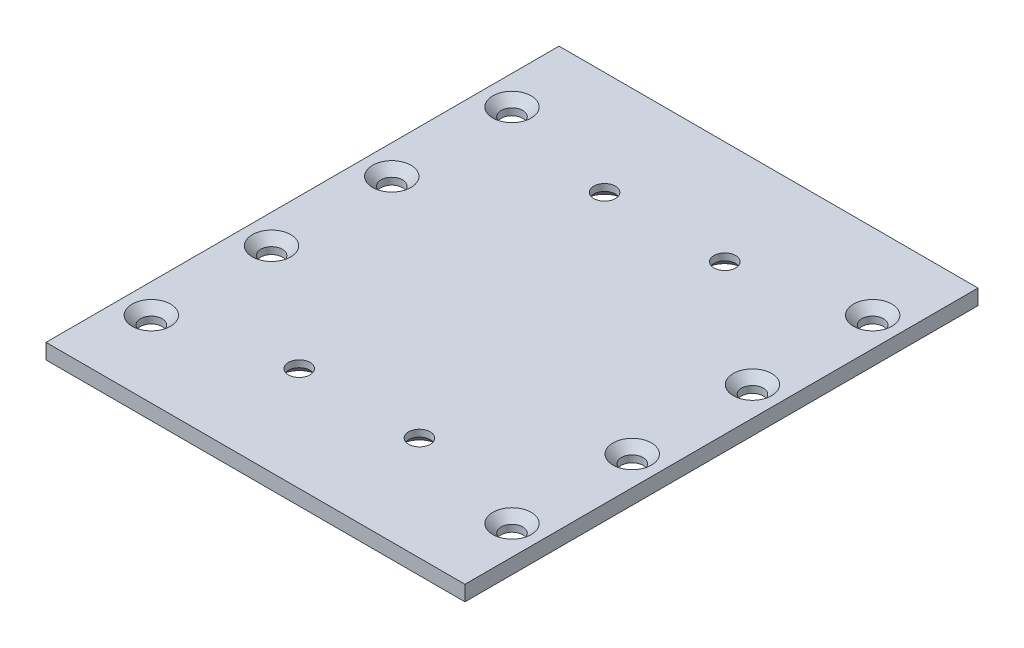
ISO-10303-21;
HEADER;
FILE_DESCRIPTION(('STEP AP214'),'2;1');
FILE_NAME('part.step','',(''),(''),'','','');
FILE_SCHEMA(('AUTOMOTIVE_DESIGN { 1 0 10303 214 1 1 1 1 }'));
ENDSEC;
DATA;
#1=APPLICATION_CONTEXT('core data for automotive mechanical design processes');
#2=APPLICATION_PROTOCOL_DEFINITION('international standard','automotive_design',2000,#1);
#3=PRODUCT_CONTEXT('',#1,'mechanical');
#4=PRODUCT('Part','Part','',(#3));
#5=PRODUCT_RELATED_PRODUCT_CATEGORY('part','',(#4));
#6=PRODUCT_DEFINITION_FORMATION('','',#4);
#7=PRODUCT_DEFINITION_CONTEXT('part definition',#1,'design');
#8=PRODUCT_DEFINITION('design','',#6,#7);
#9=PRODUCT_DEFINITION_SHAPE('','',#8);
#10=(LENGTH_UNIT() NAMED_UNIT(*) SI_UNIT(.MILLI.,.METRE.));
#11=(NAMED_UNIT(*) PLANE_ANGLE_UNIT() SI_UNIT($,.RADIAN.));
#12=(NAMED_UNIT(*) SI_UNIT($,.STERADIAN.) SOLID_ANGLE_UNIT());
#13=UNCERTAINTY_MEASURE_WITH_UNIT(LENGTH_MEASURE(1.E-05),#10,'distance_accuracy_value','');
#14=(GEOMETRIC_REPRESENTATION_CONTEXT(3) GLOBAL_UNCERTAINTY_ASSIGNED_CONTEXT((#13)) GLOBAL_UNIT_ASSIGNED_CONTEXT((#10,
#11,#12)) REPRESENTATION_CONTEXT('',''));
#15=CARTESIAN_POINT('',(0.,0.,0.));
#16=DIRECTION('',(0.,0.,1.));
#17=DIRECTION('',(1.,0.,0.));
#18=AXIS2_PLACEMENT_3D('',#15,#16,#17);
#19=CARTESIAN_POINT('',(-43.56,3.175,53.34));
#20=DIRECTION('',(0.,0.,-1.));
#21=DIRECTION('',(-1.,0.,0.));
#22=AXIS2_PLACEMENT_3D('',#19,#20,#21);
#23=PLANE('',#22);
#24=DIRECTION('',(1.,0.,0.));
#25=VECTOR('',#24,1.);
#26=CARTESIAN_POINT('',(-43.56,0.,53.34));
#27=LINE('',#26,#25);
#28=CARTESIAN_POINT('',(-43.56,0.,53.34));
#29=VERTEX_POINT('',#28);
#30=CARTESIAN_POINT('',(43.56,0.,53.34));
#31=VERTEX_POINT('',#30);
#32=EDGE_CURVE('E99',#29,#31,#27,.T.);
#33=ORIENTED_EDGE('',*,*,#32,.T.);
#34=DIRECTION('',(0.,-1.,0.));
#35=VECTOR('',#34,1.);
#36=CARTESIAN_POINT('',(43.56,3.175,53.34));
#37=LINE('',#36,#35);
#38=CARTESIAN_POINT('',(43.56,3.175,53.34));
#39=VERTEX_POINT('',#38);
#40=EDGE_CURVE('E11',#39,#31,#37,.T.);
#41=ORIENTED_EDGE('',*,*,#40,.F.);
#42=DIRECTION('',(1.,0.,0.));
#43=VECTOR('',#42,1.);
#44=CARTESIAN_POINT('',(-43.56,3.175,53.34));
#45=LINE('',#44,#43);
#46=CARTESIAN_POINT('',(-43.56,3.175,53.34));
#47=VERTEX_POINT('',#46);
#48=EDGE_CURVE('E75',#47,#39,#45,.T.);
#49=ORIENTED_EDGE('',*,*,#48,.F.);
#50=DIRECTION('',(0.,-1.,0.));
#51=VECTOR('',#50,1.);
#52=CARTESIAN_POINT('',(-43.56,3.175,53.34));
#53=LINE('',#52,#51);
#54=EDGE_CURVE('E95',#47,#29,#53,.T.);
#55=ORIENTED_EDGE('',*,*,#54,.T.);
#56=EDGE_LOOP('',(#33,#41,#49,#55));
#57=FACE_BOUND('',#56,.T.);
#58=ADVANCED_FACE('F34',(#57),#23,.F.);
#59=CARTESIAN_POINT('',(43.56,3.175,-53.34));
#60=DIRECTION('',(1.,0.,0.));
#61=DIRECTION('',(0.,0.,-1.));
#62=AXIS2_PLACEMENT_3D('',#59,#60,#61);
#63=PLANE('',#62);
#64=DIRECTION('',(0.,0.,1.));
#65=VECTOR('',#64,1.);
#66=CARTESIAN_POINT('',(43.56,0.,-53.34));
#67=LINE('',#66,#65);
#68=CARTESIAN_POINT('',(43.56,0.,-53.34));
#69=VERTEX_POINT('',#68);
#70=EDGE_CURVE('E84',#69,#31,#67,.T.);
#71=ORIENTED_EDGE('',*,*,#70,.F.);
#72=DIRECTION('',(0.,-1.,0.));
#73=VECTOR('',#72,1.);
#74=CARTESIAN_POINT('',(43.56,3.175,-53.34));
#75=LINE('',#74,#73);
#76=CARTESIAN_POINT('',(43.56,3.175,-53.34));
#77=VERTEX_POINT('',#76);
#78=EDGE_CURVE('E43',#77,#69,#75,.T.);
#79=ORIENTED_EDGE('',*,*,#78,.F.);
#80=DIRECTION('',(0.,0.,1.));
#81=VECTOR('',#80,1.);
#82=CARTESIAN_POINT('',(43.56,3.175,-53.34));
#83=LINE('',#82,#81);
#84=EDGE_CURVE('E82',#77,#39,#83,.T.);
#85=ORIENTED_EDGE('',*,*,#84,.T.);
#86=ORIENTED_EDGE('',*,*,#40,.T.);
#87=EDGE_LOOP('',(#71,#79,#85,#86));
#88=FACE_BOUND('',#87,.T.);
#89=ADVANCED_FACE('F81',(#88),#63,.T.);
#90=CARTESIAN_POINT('',(-43.56,3.175,-53.34));
#91=DIRECTION('',(0.,0.,-1.));
#92=DIRECTION('',(-1.,0.,0.));
#93=AXIS2_PLACEMENT_3D('',#90,#91,#92);
#94=PLANE('',#93);
#95=DIRECTION('',(1.,0.,0.));
#96=VECTOR('',#95,1.);
#97=CARTESIAN_POINT('',(-43.56,0.,-53.34));
#98=LINE('',#97,#96);
#99=CARTESIAN_POINT('',(-43.56,0.,-53.34));
#100=VERTEX_POINT('',#99);
#101=EDGE_CURVE('E104',#100,#69,#98,.T.);
#102=ORIENTED_EDGE('',*,*,#101,.F.);
#103=DIRECTION('',(0.,-1.,0.));
#104=VECTOR('',#103,1.);
#105=CARTESIAN_POINT('',(-43.56,3.175,-53.34));
#106=LINE('',#105,#104);
#107=CARTESIAN_POINT('',(-43.56,3.175,-53.34));
#108=VERTEX_POINT('',#107);
#109=EDGE_CURVE('E67',#108,#100,#106,.T.);
#110=ORIENTED_EDGE('',*,*,#109,.F.);
#111=DIRECTION('',(1.,0.,0.));
#112=VECTOR('',#111,1.);
#113=CARTESIAN_POINT('',(-43.56,3.175,-53.34));
#114=LINE('',#113,#112);
#115=EDGE_CURVE('E91',#108,#77,#114,.T.);
#116=ORIENTED_EDGE('',*,*,#115,.T.);
#117=ORIENTED_EDGE('',*,*,#78,.T.);
#118=EDGE_LOOP('',(#102,#110,#116,#117));
#119=FACE_BOUND('',#118,.T.);
#120=ADVANCED_FACE('F93',(#119),#94,.T.);
#121=CARTESIAN_POINT('',(-43.56,3.175,-53.34));
#122=DIRECTION('',(1.,0.,0.));
#123=DIRECTION('',(0.,0.,-1.));
#124=AXIS2_PLACEMENT_3D('',#121,#122,#123);
#125=PLANE('',#124);
#126=DIRECTION('',(0.,0.,1.));
#127=VECTOR('',#126,1.);
#128=CARTESIAN_POINT('',(-43.56,0.,-53.34));
#129=LINE('',#128,#127);
#130=EDGE_CURVE('E70',#100,#29,#129,.T.);
#131=ORIENTED_EDGE('',*,*,#130,.T.);
#132=ORIENTED_EDGE('',*,*,#54,.F.);
#133=DIRECTION('',(0.,0.,1.));
#134=VECTOR('',#133,1.);
#135=CARTESIAN_POINT('',(-43.56,3.175,-53.34));
#136=LINE('',#135,#134);
#137=EDGE_CURVE('E52',#108,#47,#136,.T.);
#138=ORIENTED_EDGE('',*,*,#137,.F.);
#139=ORIENTED_EDGE('',*,*,#109,.T.);
#140=EDGE_LOOP('',(#131,#132,#138,#139));
#141=FACE_BOUND('',#140,.T.);
#142=ADVANCED_FACE('F216',(#141),#125,.F.);
#143=CARTESIAN_POINT('',(0.,3.175,0.));
#144=DIRECTION('',(0.,-1.,0.));
#145=DIRECTION('',(0.,0.,-1.));
#146=AXIS2_PLACEMENT_3D('',#143,#144,#145);
#147=PLANE('',#146);
#148=CARTESIAN_POINT('',(12.5,3.175,31.75));
#149=DIRECTION('',(0.,-1.,0.));
#150=DIRECTION('',(0.,0.,-1.));
#151=AXIS2_PLACEMENT_3D('',#148,#149,#150);
#152=CIRCLE('',#151,2.25);
#153=CARTESIAN_POINT('',(12.5,3.175,29.5));
#154=VERTEX_POINT('',#153);
#155=EDGE_CURVE('E37',#154,#154,#152,.T.);
#156=ORIENTED_EDGE('',*,*,#155,.T.);
#157=EDGE_LOOP('',(#156));
#158=FACE_BOUND('',#157,.T.);
#159=CARTESIAN_POINT('',(-12.5,3.175,31.75));
#160=DIRECTION('',(0.,-1.,0.));
#161=DIRECTION('',(0.,0.,-1.));
#162=AXIS2_PLACEMENT_3D('',#159,#160,#161);
#163=CIRCLE('',#162,2.25);
#164=CARTESIAN_POINT('',(-12.5,3.175,29.5));
#165=VERTEX_POINT('',#164);
#166=EDGE_CURVE('E118',#165,#165,#163,.T.);
#167=ORIENTED_EDGE('',*,*,#166,.T.);
#168=EDGE_LOOP('',(#167));
#169=FACE_BOUND('',#168,.T.);
#170=CARTESIAN_POINT('',(12.5,3.175,-31.75));
#171=DIRECTION('',(0.,-1.,0.));
#172=DIRECTION('',(0.,0.,-1.));
#173=AXIS2_PLACEMENT_3D('',#170,#171,#172);
#174=CIRCLE('',#173,2.25);
#175=CARTESIAN_POINT('',(12.5,3.175,-34.));
#176=VERTEX_POINT('',#175);
#177=EDGE_CURVE('E114',#176,#176,#174,.T.);
#178=ORIENTED_EDGE('',*,*,#177,.T.);
#179=EDGE_LOOP('',(#178));
#180=FACE_BOUND('',#179,.T.);
#181=CARTESIAN_POINT('',(-12.5,3.175,-31.75));
#182=DIRECTION('',(0.,-1.,0.));
#183=DIRECTION('',(0.,0.,-1.));
#184=AXIS2_PLACEMENT_3D('',#181,#182,#183);
#185=CIRCLE('',#184,2.25);
#186=CARTESIAN_POINT('',(-12.5,3.175,-34.));
#187=VERTEX_POINT('',#186);
#188=EDGE_CURVE('E109',#187,#187,#185,.T.);
#189=ORIENTED_EDGE('',*,*,#188,.T.);
#190=EDGE_LOOP('',(#189));
#191=FACE_BOUND('',#190,.T.);
#192=CARTESIAN_POINT('',(-37.5000000000002,3.175,-37.5));
#193=DIRECTION('',(0.,1.,0.));
#194=DIRECTION('',(0.,0.,1.));
#195=AXIS2_PLACEMENT_3D('',#192,#193,#194);
#196=CIRCLE('',#195,4.);
#197=CARTESIAN_POINT('',(-37.5000000000002,3.175,-33.5));
#198=VERTEX_POINT('',#197);
#199=EDGE_CURVE('E146',#198,#198,#196,.T.);
#200=ORIENTED_EDGE('',*,*,#199,.F.);
#201=EDGE_LOOP('',(#200));
#202=FACE_BOUND('',#201,.T.);
#203=CARTESIAN_POINT('',(-37.5000000000002,3.175,-12.5));
#204=DIRECTION('',(0.,1.,0.));
#205=DIRECTION('',(0.,0.,1.));
#206=AXIS2_PLACEMENT_3D('',#203,#204,#205);
#207=CIRCLE('',#206,4.);
#208=CARTESIAN_POINT('',(-37.5000000000002,3.175,-8.50000000000001));
#209=VERTEX_POINT('',#208);
#210=EDGE_CURVE('E155',#209,#209,#207,.T.);
#211=ORIENTED_EDGE('',*,*,#210,.F.);
#212=EDGE_LOOP('',(#211));
#213=FACE_BOUND('',#212,.T.);
#214=CARTESIAN_POINT('',(37.4999999999998,3.175,-37.5));
#215=DIRECTION('',(0.,1.,0.));
#216=DIRECTION('',(0.,0.,1.));
#217=AXIS2_PLACEMENT_3D('',#214,#215,#216);
#218=CIRCLE('',#217,4.);
#219=CARTESIAN_POINT('',(37.4999999999998,3.175,-33.5));
#220=VERTEX_POINT('',#219);
#221=EDGE_CURVE('E164',#220,#220,#218,.T.);
#222=ORIENTED_EDGE('',*,*,#221,.F.);
#223=EDGE_LOOP('',(#222));
#224=FACE_BOUND('',#223,.T.);
#225=CARTESIAN_POINT('',(37.4999999999999,3.175,-12.5));
#226=DIRECTION('',(0.,1.,0.));
#227=DIRECTION('',(0.,0.,1.));
#228=AXIS2_PLACEMENT_3D('',#225,#226,#227);
#229=CIRCLE('',#228,4.);
#230=CARTESIAN_POINT('',(37.4999999999999,3.175,-8.5));
#231=VERTEX_POINT('',#230);
#232=EDGE_CURVE('E173',#231,#231,#229,.T.);
#233=ORIENTED_EDGE('',*,*,#232,.F.);
#234=EDGE_LOOP('',(#233));
#235=FACE_BOUND('',#234,.T.);
#236=CARTESIAN_POINT('',(37.4999999999999,3.175,12.5));
#237=DIRECTION('',(0.,1.,0.));
#238=DIRECTION('',(0.,0.,1.));
#239=AXIS2_PLACEMENT_3D('',#236,#237,#238);
#240=CIRCLE('',#239,4.);
#241=CARTESIAN_POINT('',(37.4999999999999,3.175,16.5));
#242=VERTEX_POINT('',#241);
#243=EDGE_CURVE('E182',#242,#242,#240,.T.);
#244=ORIENTED_EDGE('',*,*,#243,.F.);
#245=EDGE_LOOP('',(#244));
#246=FACE_BOUND('',#245,.T.);
#247=CARTESIAN_POINT('',(37.5,3.175,37.5));
#248=DIRECTION('',(0.,1.,0.));
#249=DIRECTION('',(0.,0.,1.));
#250=AXIS2_PLACEMENT_3D('',#247,#248,#249);
#251=CIRCLE('',#250,4.);
#252=CARTESIAN_POINT('',(37.5,3.175,41.5));
#253=VERTEX_POINT('',#252);
#254=EDGE_CURVE('E191',#253,#253,#251,.T.);
#255=ORIENTED_EDGE('',*,*,#254,.F.);
#256=EDGE_LOOP('',(#255));
#257=FACE_BOUND('',#256,.T.);
#258=CARTESIAN_POINT('',(-37.5,3.175,37.5));
#259=DIRECTION('',(0.,1.,0.));
#260=DIRECTION('',(0.,0.,1.));
#261=AXIS2_PLACEMENT_3D('',#258,#259,#260);
#262=CIRCLE('',#261,4.);
#263=CARTESIAN_POINT('',(-37.5,3.175,41.5));
#264=VERTEX_POINT('',#263);
#265=EDGE_CURVE('E200',#264,#264,#262,.T.);
#266=ORIENTED_EDGE('',*,*,#265,.F.);
#267=EDGE_LOOP('',(#266));
#268=FACE_BOUND('',#267,.T.);
#269=CARTESIAN_POINT('',(-37.5000000000001,3.175,12.5));
#270=DIRECTION('',(0.,1.,0.));
#271=DIRECTION('',(0.,0.,1.));
#272=AXIS2_PLACEMENT_3D('',#269,#270,#271);
#273=CIRCLE('',#272,4.);
#274=CARTESIAN_POINT('',(-37.5000000000001,3.175,16.5));
#275=VERTEX_POINT('',#274);
#276=EDGE_CURVE('E102',#275,#275,#273,.T.);
#277=ORIENTED_EDGE('',*,*,#276,.F.);
#278=EDGE_LOOP('',(#277));
#279=FACE_BOUND('',#278,.T.);
#280=ORIENTED_EDGE('',*,*,#48,.T.);
#281=ORIENTED_EDGE('',*,*,#84,.F.);
#282=ORIENTED_EDGE('',*,*,#115,.F.);
#283=ORIENTED_EDGE('',*,*,#137,.T.);
#284=EDGE_LOOP('',(#280,#281,#282,#283));
#285=FACE_BOUND('',#284,.T.);
#286=ADVANCED_FACE('F90',(#158,#169,#180,#191,#202,#213,#224,#235,#246,#257,#268,#279,#285),
#147,.F.);
#287=CARTESIAN_POINT('',(0.,0.,0.));
#288=DIRECTION('',(0.,-1.,0.));
#289=DIRECTION('',(0.,0.,-1.));
#290=AXIS2_PLACEMENT_3D('',#287,#288,#289);
#291=PLANE('',#290);
#292=CARTESIAN_POINT('',(12.5,0.,31.75));
#293=DIRECTION('',(0.,-1.,0.));
#294=DIRECTION('',(0.,0.,-1.));
#295=AXIS2_PLACEMENT_3D('',#292,#293,#294);
#296=CIRCLE('',#295,4.);
#297=CARTESIAN_POINT('',(12.5,0.,27.75));
#298=VERTEX_POINT('',#297);
#299=EDGE_CURVE('E502',#298,#298,#296,.T.);
#300=ORIENTED_EDGE('',*,*,#299,.F.);
#301=EDGE_LOOP('',(#300));
#302=FACE_BOUND('',#301,.T.);
#303=CARTESIAN_POINT('',(-12.5,0.,31.75));
#304=DIRECTION('',(0.,-1.,0.));
#305=DIRECTION('',(0.,0.,-1.));
#306=AXIS2_PLACEMENT_3D('',#303,#304,#305);
#307=CIRCLE('',#306,4.);
#308=CARTESIAN_POINT('',(-12.5,0.,27.75));
#309=VERTEX_POINT('',#308);
#310=EDGE_CURVE('E127',#309,#309,#307,.T.);
#311=ORIENTED_EDGE('',*,*,#310,.F.);
#312=EDGE_LOOP('',(#311));
#313=FACE_BOUND('',#312,.T.);
#314=CARTESIAN_POINT('',(12.5,0.,-31.75));
#315=DIRECTION('',(0.,-1.,0.));
#316=DIRECTION('',(0.,0.,-1.));
#317=AXIS2_PLACEMENT_3D('',#314,#315,#316);
#318=CIRCLE('',#317,4.);
#319=CARTESIAN_POINT('',(12.5,0.,-35.75));
#320=VERTEX_POINT('',#319);
#321=EDGE_CURVE('E120',#320,#320,#318,.T.);
#322=ORIENTED_EDGE('',*,*,#321,.F.);
#323=EDGE_LOOP('',(#322));
#324=FACE_BOUND('',#323,.T.);
#325=CARTESIAN_POINT('',(-12.5,0.,-31.75));
#326=DIRECTION('',(0.,-1.,0.));
#327=DIRECTION('',(0.,0.,-1.));
#328=AXIS2_PLACEMENT_3D('',#325,#326,#327);
#329=CIRCLE('',#328,4.);
#330=CARTESIAN_POINT('',(-12.5,0.,-35.75));
#331=VERTEX_POINT('',#330);
#332=EDGE_CURVE('E116',#331,#331,#329,.T.);
#333=ORIENTED_EDGE('',*,*,#332,.F.);
#334=EDGE_LOOP('',(#333));
#335=FACE_BOUND('',#334,.T.);
#336=CARTESIAN_POINT('',(-37.5000000000002,0.,-37.5));
#337=DIRECTION('',(0.,1.,0.));
#338=DIRECTION('',(0.,0.,1.));
#339=AXIS2_PLACEMENT_3D('',#336,#337,#338);
#340=CIRCLE('',#339,2.25);
#341=CARTESIAN_POINT('',(-37.5000000000002,0.,-35.25));
#342=VERTEX_POINT('',#341);
#343=EDGE_CURVE('E112',#342,#342,#340,.T.);
#344=ORIENTED_EDGE('',*,*,#343,.T.);
#345=EDGE_LOOP('',(#344));
#346=FACE_BOUND('',#345,.T.);
#347=CARTESIAN_POINT('',(-37.5000000000002,0.,-12.5));
#348=DIRECTION('',(0.,1.,0.));
#349=DIRECTION('',(0.,0.,1.));
#350=AXIS2_PLACEMENT_3D('',#347,#348,#349);
#351=CIRCLE('',#350,2.25);
#352=CARTESIAN_POINT('',(-37.5000000000002,0.,-10.25));
#353=VERTEX_POINT('',#352);
#354=EDGE_CURVE('E149',#353,#353,#351,.T.);
#355=ORIENTED_EDGE('',*,*,#354,.T.);
#356=EDGE_LOOP('',(#355));
#357=FACE_BOUND('',#356,.T.);
#358=CARTESIAN_POINT('',(37.4999999999998,0.,-37.5));
#359=DIRECTION('',(0.,1.,0.));
#360=DIRECTION('',(0.,0.,1.));
#361=AXIS2_PLACEMENT_3D('',#358,#359,#360);
#362=CIRCLE('',#361,2.25);
#363=CARTESIAN_POINT('',(37.4999999999998,0.,-35.25));
#364=VERTEX_POINT('',#363);
#365=EDGE_CURVE('E158',#364,#364,#362,.T.);
#366=ORIENTED_EDGE('',*,*,#365,.T.);
#367=EDGE_LOOP('',(#366));
#368=FACE_BOUND('',#367,.T.);
#369=CARTESIAN_POINT('',(37.4999999999999,0.,-12.5));
#370=DIRECTION('',(0.,1.,0.));
#371=DIRECTION('',(0.,0.,1.));
#372=AXIS2_PLACEMENT_3D('',#369,#370,#371);
#373=CIRCLE('',#372,2.25);
#374=CARTESIAN_POINT('',(37.4999999999999,0.,-10.25));
#375=VERTEX_POINT('',#374);
#376=EDGE_CURVE('E167',#375,#375,#373,.T.);
#377=ORIENTED_EDGE('',*,*,#376,.T.);
#378=EDGE_LOOP('',(#377));
#379=FACE_BOUND('',#378,.T.);
#380=CARTESIAN_POINT('',(37.4999999999999,0.,12.5));
#381=DIRECTION('',(0.,1.,0.));
#382=DIRECTION('',(0.,0.,1.));
#383=AXIS2_PLACEMENT_3D('',#380,#381,#382);
#384=CIRCLE('',#383,2.25);
#385=CARTESIAN_POINT('',(37.4999999999999,0.,14.75));
#386=VERTEX_POINT('',#385);
#387=EDGE_CURVE('E176',#386,#386,#384,.T.);
#388=ORIENTED_EDGE('',*,*,#387,.T.);
#389=EDGE_LOOP('',(#388));
#390=FACE_BOUND('',#389,.T.);
#391=CARTESIAN_POINT('',(37.5,0.,37.5));
#392=DIRECTION('',(0.,1.,0.));
#393=DIRECTION('',(0.,0.,1.));
#394=AXIS2_PLACEMENT_3D('',#391,#392,#393);
#395=CIRCLE('',#394,2.25);
#396=CARTESIAN_POINT('',(37.5,0.,39.75));
#397=VERTEX_POINT('',#396);
#398=EDGE_CURVE('E185',#397,#397,#395,.T.);
#399=ORIENTED_EDGE('',*,*,#398,.T.);
#400=EDGE_LOOP('',(#399));
#401=FACE_BOUND('',#400,.T.);
#402=CARTESIAN_POINT('',(-37.5,0.,37.5));
#403=DIRECTION('',(0.,1.,0.));
#404=DIRECTION('',(0.,0.,1.));
#405=AXIS2_PLACEMENT_3D('',#402,#403,#404);
#406=CIRCLE('',#405,2.25);
#407=CARTESIAN_POINT('',(-37.5,0.,39.75));
#408=VERTEX_POINT('',#407);
#409=EDGE_CURVE('E194',#408,#408,#406,.T.);
#410=ORIENTED_EDGE('',*,*,#409,.T.);
#411=EDGE_LOOP('',(#410));
#412=FACE_BOUND('',#411,.T.);
#413=CARTESIAN_POINT('',(-37.5000000000001,0.,12.5));
#414=DIRECTION('',(0.,1.,0.));
#415=DIRECTION('',(0.,0.,1.));
#416=AXIS2_PLACEMENT_3D('',#413,#414,#415);
#417=CIRCLE('',#416,2.25);
#418=CARTESIAN_POINT('',(-37.5000000000001,0.,14.75));
#419=VERTEX_POINT('',#418);
#420=EDGE_CURVE('E203',#419,#419,#417,.T.);
#421=ORIENTED_EDGE('',*,*,#420,.T.);
#422=EDGE_LOOP('',(#421));
#423=FACE_BOUND('',#422,.T.);
#424=ORIENTED_EDGE('',*,*,#32,.F.);
#425=ORIENTED_EDGE('',*,*,#130,.F.);
#426=ORIENTED_EDGE('',*,*,#101,.T.);
#427=ORIENTED_EDGE('',*,*,#70,.T.);
#428=EDGE_LOOP('',(#424,#425,#426,#427));
#429=FACE_BOUND('',#428,.T.);
#430=ADVANCED_FACE('F215',(#302,#313,#324,#335,#346,#357,#368,#379,#390,#401,#412,#423,#429),
#291,.T.);
#431=CARTESIAN_POINT('',(-37.5000000000001,3.175,12.5));
#432=DIRECTION('',(0.,1.,0.));
#433=DIRECTION('',(0.,0.,1.));
#434=AXIS2_PLACEMENT_3D('',#431,#432,#433);
#435=CONICAL_SURFACE('',#434,4.,0.785398163397449);
#436=CARTESIAN_POINT('',(-37.5000000000001,1.425,12.5));
#437=DIRECTION('',(0.,1.,0.));
#438=DIRECTION('',(0.,0.,1.));
#439=AXIS2_PLACEMENT_3D('',#436,#437,#438);
#440=CIRCLE('',#439,2.25);
#441=CARTESIAN_POINT('',(-37.5000000000001,1.425,14.75));
#442=VERTEX_POINT('',#441);
#443=EDGE_CURVE('E206',#442,#442,#440,.T.);
#444=ORIENTED_EDGE('',*,*,#443,.F.);
#445=EDGE_LOOP('',(#444));
#446=FACE_BOUND('',#445,.T.);
#447=ORIENTED_EDGE('',*,*,#276,.T.);
#448=EDGE_LOOP('',(#447));
#449=FACE_BOUND('',#448,.T.);
#450=ADVANCED_FACE('F212',(#446,#449),#435,.F.);
#451=CARTESIAN_POINT('',(-37.5000000000001,3.175,12.5));
#452=DIRECTION('',(0.,1.,0.));
#453=DIRECTION('',(0.,0.,1.));
#454=AXIS2_PLACEMENT_3D('',#451,#452,#453);
#455=CYLINDRICAL_SURFACE('',#454,2.25);
#456=ORIENTED_EDGE('',*,*,#420,.F.);
#457=EDGE_LOOP('',(#456));
#458=FACE_BOUND('',#457,.T.);
#459=ORIENTED_EDGE('',*,*,#443,.T.);
#460=EDGE_LOOP('',(#459));
#461=FACE_BOUND('',#460,.T.);
#462=ADVANCED_FACE('F255',(#458,#461),#455,.F.);
#463=CARTESIAN_POINT('',(-37.5,3.175,37.5));
#464=DIRECTION('',(0.,1.,0.));
#465=DIRECTION('',(0.,0.,1.));
#466=AXIS2_PLACEMENT_3D('',#463,#464,#465);
#467=CONICAL_SURFACE('',#466,4.,0.785398163397449);
#468=CARTESIAN_POINT('',(-37.5,1.425,37.5));
#469=DIRECTION('',(0.,1.,0.));
#470=DIRECTION('',(0.,0.,1.));
#471=AXIS2_PLACEMENT_3D('',#468,#469,#470);
#472=CIRCLE('',#471,2.25);
#473=CARTESIAN_POINT('',(-37.5,1.425,39.75));
#474=VERTEX_POINT('',#473);
#475=EDGE_CURVE('E197',#474,#474,#472,.T.);
#476=ORIENTED_EDGE('',*,*,#475,.F.);
#477=EDGE_LOOP('',(#476));
#478=FACE_BOUND('',#477,.T.);
#479=ORIENTED_EDGE('',*,*,#265,.T.);
#480=EDGE_LOOP('',(#479));
#481=FACE_BOUND('',#480,.T.);
#482=ADVANCED_FACE('F265',(#478,#481),#467,.F.);
#483=CARTESIAN_POINT('',(-37.5,3.175,37.5));
#484=DIRECTION('',(0.,1.,0.));
#485=DIRECTION('',(0.,0.,1.));
#486=AXIS2_PLACEMENT_3D('',#483,#484,#485);
#487=CYLINDRICAL_SURFACE('',#486,2.25);
#488=ORIENTED_EDGE('',*,*,#409,.F.);
#489=EDGE_LOOP('',(#488));
#490=FACE_BOUND('',#489,.T.);
#491=ORIENTED_EDGE('',*,*,#475,.T.);
#492=EDGE_LOOP('',(#491));
#493=FACE_BOUND('',#492,.T.);
#494=ADVANCED_FACE('F275',(#490,#493),#487,.F.);
#495=CARTESIAN_POINT('',(37.5,3.175,37.5));
#496=DIRECTION('',(0.,1.,0.));
#497=DIRECTION('',(0.,0.,1.));
#498=AXIS2_PLACEMENT_3D('',#495,#496,#497);
#499=CONICAL_SURFACE('',#498,4.,0.785398163397449);
#500=CARTESIAN_POINT('',(37.5,1.425,37.5));
#501=DIRECTION('',(0.,1.,0.));
#502=DIRECTION('',(0.,0.,1.));
#503=AXIS2_PLACEMENT_3D('',#500,#501,#502);
#504=CIRCLE('',#503,2.25);
#505=CARTESIAN_POINT('',(37.5,1.425,39.75));
#506=VERTEX_POINT('',#505);
#507=EDGE_CURVE('E188',#506,#506,#504,.T.);
#508=ORIENTED_EDGE('',*,*,#507,.F.);
#509=EDGE_LOOP('',(#508));
#510=FACE_BOUND('',#509,.T.);
#511=ORIENTED_EDGE('',*,*,#254,.T.);
#512=EDGE_LOOP('',(#511));
#513=FACE_BOUND('',#512,.T.);
#514=ADVANCED_FACE('F285',(#510,#513),#499,.F.);
#515=CARTESIAN_POINT('',(37.5,3.175,37.5));
#516=DIRECTION('',(0.,1.,0.));
#517=DIRECTION('',(0.,0.,1.));
#518=AXIS2_PLACEMENT_3D('',#515,#516,#517);
#519=CYLINDRICAL_SURFACE('',#518,2.25);
#520=ORIENTED_EDGE('',*,*,#398,.F.);
#521=EDGE_LOOP('',(#520));
#522=FACE_BOUND('',#521,.T.);
#523=ORIENTED_EDGE('',*,*,#507,.T.);
#524=EDGE_LOOP('',(#523));
#525=FACE_BOUND('',#524,.T.);
#526=ADVANCED_FACE('F295',(#522,#525),#519,.F.);
#527=CARTESIAN_POINT('',(37.4999999999999,3.175,12.5));
#528=DIRECTION('',(0.,1.,0.));
#529=DIRECTION('',(0.,0.,1.));
#530=AXIS2_PLACEMENT_3D('',#527,#528,#529);
#531=CONICAL_SURFACE('',#530,4.,0.785398163397449);
#532=CARTESIAN_POINT('',(37.4999999999999,1.425,12.5));
#533=DIRECTION('',(0.,1.,0.));
#534=DIRECTION('',(0.,0.,1.));
#535=AXIS2_PLACEMENT_3D('',#532,#533,#534);
#536=CIRCLE('',#535,2.25);
#537=CARTESIAN_POINT('',(37.4999999999999,1.425,14.75));
#538=VERTEX_POINT('',#537);
#539=EDGE_CURVE('E179',#538,#538,#536,.T.);
#540=ORIENTED_EDGE('',*,*,#539,.F.);
#541=EDGE_LOOP('',(#540));
#542=FACE_BOUND('',#541,.T.);
#543=ORIENTED_EDGE('',*,*,#243,.T.);
#544=EDGE_LOOP('',(#543));
#545=FACE_BOUND('',#544,.T.);
#546=ADVANCED_FACE('F305',(#542,#545),#531,.F.);
#547=CARTESIAN_POINT('',(37.4999999999999,3.175,12.5));
#548=DIRECTION('',(0.,1.,0.));
#549=DIRECTION('',(0.,0.,1.));
#550=AXIS2_PLACEMENT_3D('',#547,#548,#549);
#551=CYLINDRICAL_SURFACE('',#550,2.25);
#552=ORIENTED_EDGE('',*,*,#387,.F.);
#553=EDGE_LOOP('',(#552));
#554=FACE_BOUND('',#553,.T.);
#555=ORIENTED_EDGE('',*,*,#539,.T.);
#556=EDGE_LOOP('',(#555));
#557=FACE_BOUND('',#556,.T.);
#558=ADVANCED_FACE('F315',(#554,#557),#551,.F.);
#559=CARTESIAN_POINT('',(37.4999999999999,3.175,-12.5));
#560=DIRECTION('',(0.,1.,0.));
#561=DIRECTION('',(0.,0.,1.));
#562=AXIS2_PLACEMENT_3D('',#559,#560,#561);
#563=CONICAL_SURFACE('',#562,4.,0.785398163397449);
#564=CARTESIAN_POINT('',(37.4999999999999,1.425,-12.5));
#565=DIRECTION('',(0.,1.,0.));
#566=DIRECTION('',(0.,0.,1.));
#567=AXIS2_PLACEMENT_3D('',#564,#565,#566);
#568=CIRCLE('',#567,2.25);
#569=CARTESIAN_POINT('',(37.4999999999999,1.425,-10.25));
#570=VERTEX_POINT('',#569);
#571=EDGE_CURVE('E170',#570,#570,#568,.T.);
#572=ORIENTED_EDGE('',*,*,#571,.F.);
#573=EDGE_LOOP('',(#572));
#574=FACE_BOUND('',#573,.T.);
#575=ORIENTED_EDGE('',*,*,#232,.T.);
#576=EDGE_LOOP('',(#575));
#577=FACE_BOUND('',#576,.T.);
#578=ADVANCED_FACE('F325',(#574,#577),#563,.F.);
#579=CARTESIAN_POINT('',(37.4999999999999,3.175,-12.5));
#580=DIRECTION('',(0.,1.,0.));
#581=DIRECTION('',(0.,0.,1.));
#582=AXIS2_PLACEMENT_3D('',#579,#580,#581);
#583=CYLINDRICAL_SURFACE('',#582,2.25);
#584=ORIENTED_EDGE('',*,*,#376,.F.);
#585=EDGE_LOOP('',(#584));
#586=FACE_BOUND('',#585,.T.);
#587=ORIENTED_EDGE('',*,*,#571,.T.);
#588=EDGE_LOOP('',(#587));
#589=FACE_BOUND('',#588,.T.);
#590=ADVANCED_FACE('F335',(#586,#589),#583,.F.);
#591=CARTESIAN_POINT('',(37.4999999999998,3.175,-37.5));
#592=DIRECTION('',(0.,1.,0.));
#593=DIRECTION('',(0.,0.,1.));
#594=AXIS2_PLACEMENT_3D('',#591,#592,#593);
#595=CONICAL_SURFACE('',#594,4.,0.785398163397449);
#596=CARTESIAN_POINT('',(37.4999999999998,1.425,-37.5));
#597=DIRECTION('',(0.,1.,0.));
#598=DIRECTION('',(0.,0.,1.));
#599=AXIS2_PLACEMENT_3D('',#596,#597,#598);
#600=CIRCLE('',#599,2.25);
#601=CARTESIAN_POINT('',(37.4999999999998,1.425,-35.25));
#602=VERTEX_POINT('',#601);
#603=EDGE_CURVE('E161',#602,#602,#600,.T.);
#604=ORIENTED_EDGE('',*,*,#603,.F.);
#605=EDGE_LOOP('',(#604));
#606=FACE_BOUND('',#605,.T.);
#607=ORIENTED_EDGE('',*,*,#221,.T.);
#608=EDGE_LOOP('',(#607));
#609=FACE_BOUND('',#608,.T.);
#610=ADVANCED_FACE('F345',(#606,#609),#595,.F.);
#611=CARTESIAN_POINT('',(37.4999999999998,3.175,-37.5));
#612=DIRECTION('',(0.,1.,0.));
#613=DIRECTION('',(0.,0.,1.));
#614=AXIS2_PLACEMENT_3D('',#611,#612,#613);
#615=CYLINDRICAL_SURFACE('',#614,2.25);
#616=ORIENTED_EDGE('',*,*,#365,.F.);
#617=EDGE_LOOP('',(#616));
#618=FACE_BOUND('',#617,.T.);
#619=ORIENTED_EDGE('',*,*,#603,.T.);
#620=EDGE_LOOP('',(#619));
#621=FACE_BOUND('',#620,.T.);
#622=ADVANCED_FACE('F355',(#618,#621),#615,.F.);
#623=CARTESIAN_POINT('',(-37.5000000000002,3.175,-12.5));
#624=DIRECTION('',(0.,1.,0.));
#625=DIRECTION('',(0.,0.,1.));
#626=AXIS2_PLACEMENT_3D('',#623,#624,#625);
#627=CONICAL_SURFACE('',#626,4.,0.785398163397447);
#628=CARTESIAN_POINT('',(-37.5000000000002,1.425,-12.5));
#629=DIRECTION('',(0.,1.,0.));
#630=DIRECTION('',(0.,0.,1.));
#631=AXIS2_PLACEMENT_3D('',#628,#629,#630);
#632=CIRCLE('',#631,2.25);
#633=CARTESIAN_POINT('',(-37.5000000000002,1.425,-10.25));
#634=VERTEX_POINT('',#633);
#635=EDGE_CURVE('E152',#634,#634,#632,.T.);
#636=ORIENTED_EDGE('',*,*,#635,.F.);
#637=EDGE_LOOP('',(#636));
#638=FACE_BOUND('',#637,.T.);
#639=ORIENTED_EDGE('',*,*,#210,.T.);
#640=EDGE_LOOP('',(#639));
#641=FACE_BOUND('',#640,.T.);
#642=ADVANCED_FACE('F365',(#638,#641),#627,.F.);
#643=CARTESIAN_POINT('',(-37.5000000000002,3.175,-12.5));
#644=DIRECTION('',(0.,1.,0.));
#645=DIRECTION('',(0.,0.,1.));
#646=AXIS2_PLACEMENT_3D('',#643,#644,#645);
#647=CYLINDRICAL_SURFACE('',#646,2.25);
#648=ORIENTED_EDGE('',*,*,#354,.F.);
#649=EDGE_LOOP('',(#648));
#650=FACE_BOUND('',#649,.T.);
#651=ORIENTED_EDGE('',*,*,#635,.T.);
#652=EDGE_LOOP('',(#651));
#653=FACE_BOUND('',#652,.T.);
#654=ADVANCED_FACE('F375',(#650,#653),#647,.F.);
#655=CARTESIAN_POINT('',(-37.5000000000002,3.175,-37.5));
#656=DIRECTION('',(0.,1.,0.));
#657=DIRECTION('',(0.,0.,1.));
#658=AXIS2_PLACEMENT_3D('',#655,#656,#657);
#659=CONICAL_SURFACE('',#658,4.,0.785398163397447);
#660=CARTESIAN_POINT('',(-37.5000000000002,1.425,-37.5));
#661=DIRECTION('',(0.,1.,0.));
#662=DIRECTION('',(0.,0.,1.));
#663=AXIS2_PLACEMENT_3D('',#660,#661,#662);
#664=CIRCLE('',#663,2.25);
#665=CARTESIAN_POINT('',(-37.5000000000002,1.425,-35.25));
#666=VERTEX_POINT('',#665);
#667=EDGE_CURVE('E143',#666,#666,#664,.T.);
#668=ORIENTED_EDGE('',*,*,#667,.F.);
#669=EDGE_LOOP('',(#668));
#670=FACE_BOUND('',#669,.T.);
#671=ORIENTED_EDGE('',*,*,#199,.T.);
#672=EDGE_LOOP('',(#671));
#673=FACE_BOUND('',#672,.T.);
#674=ADVANCED_FACE('F385',(#670,#673),#659,.F.);
#675=CARTESIAN_POINT('',(-37.5000000000002,3.175,-37.5));
#676=DIRECTION('',(0.,1.,0.));
#677=DIRECTION('',(0.,0.,1.));
#678=AXIS2_PLACEMENT_3D('',#675,#676,#677);
#679=CYLINDRICAL_SURFACE('',#678,2.25);
#680=ORIENTED_EDGE('',*,*,#343,.F.);
#681=EDGE_LOOP('',(#680));
#682=FACE_BOUND('',#681,.T.);
#683=ORIENTED_EDGE('',*,*,#667,.T.);
#684=EDGE_LOOP('',(#683));
#685=FACE_BOUND('',#684,.T.);
#686=ADVANCED_FACE('F395',(#682,#685),#679,.F.);
#687=CARTESIAN_POINT('',(-12.5,0.,-31.75));
#688=DIRECTION('',(0.,-1.,0.));
#689=DIRECTION('',(0.,0.,-1.));
#690=AXIS2_PLACEMENT_3D('',#687,#688,#689);
#691=CYLINDRICAL_SURFACE('',#690,2.25);
#692=CARTESIAN_POINT('',(-12.5,1.75,-31.75));
#693=DIRECTION('',(0.,-1.,0.));
#694=DIRECTION('',(0.,0.,-1.));
#695=AXIS2_PLACEMENT_3D('',#692,#693,#694);
#696=CIRCLE('',#695,2.25);
#697=CARTESIAN_POINT('',(-12.5,1.75,-34.));
#698=VERTEX_POINT('',#697);
#699=EDGE_CURVE('E113',#698,#698,#696,.T.);
#700=ORIENTED_EDGE('',*,*,#699,.T.);
#701=EDGE_LOOP('',(#700));
#702=FACE_BOUND('',#701,.T.);
#703=ORIENTED_EDGE('',*,*,#188,.F.);
#704=EDGE_LOOP('',(#703));
#705=FACE_BOUND('',#704,.T.);
#706=ADVANCED_FACE('F405',(#702,#705),#691,.F.);
#707=CARTESIAN_POINT('',(-12.5,0.,-31.75));
#708=DIRECTION('',(0.,-1.,0.));
#709=DIRECTION('',(0.,0.,-1.));
#710=AXIS2_PLACEMENT_3D('',#707,#708,#709);
#711=CONICAL_SURFACE('',#710,4.,0.785398163397449);
#712=ORIENTED_EDGE('',*,*,#699,.F.);
#713=EDGE_LOOP('',(#712));
#714=FACE_BOUND('',#713,.T.);
#715=ORIENTED_EDGE('',*,*,#332,.T.);
#716=EDGE_LOOP('',(#715));
#717=FACE_BOUND('',#716,.T.);
#718=ADVANCED_FACE('F415',(#714,#717),#711,.F.);
#719=CARTESIAN_POINT('',(12.5,0.,-31.75));
#720=DIRECTION('',(0.,-1.,0.));
#721=DIRECTION('',(0.,0.,-1.));
#722=AXIS2_PLACEMENT_3D('',#719,#720,#721);
#723=CYLINDRICAL_SURFACE('',#722,2.25);
#724=CARTESIAN_POINT('',(12.5,1.75,-31.75));
#725=DIRECTION('',(0.,-1.,0.));
#726=DIRECTION('',(0.,0.,-1.));
#727=AXIS2_PLACEMENT_3D('',#724,#725,#726);
#728=CIRCLE('',#727,2.25);
#729=CARTESIAN_POINT('',(12.5,1.75,-34.));
#730=VERTEX_POINT('',#729);
#731=EDGE_CURVE('E117',#730,#730,#728,.T.);
#732=ORIENTED_EDGE('',*,*,#731,.T.);
#733=EDGE_LOOP('',(#732));
#734=FACE_BOUND('',#733,.T.);
#735=ORIENTED_EDGE('',*,*,#177,.F.);
#736=EDGE_LOOP('',(#735));
#737=FACE_BOUND('',#736,.T.);
#738=ADVANCED_FACE('F425',(#734,#737),#723,.F.);
#739=CARTESIAN_POINT('',(12.5,0.,-31.75));
#740=DIRECTION('',(0.,-1.,0.));
#741=DIRECTION('',(0.,0.,-1.));
#742=AXIS2_PLACEMENT_3D('',#739,#740,#741);
#743=CONICAL_SURFACE('',#742,4.,0.785398163397449);
#744=ORIENTED_EDGE('',*,*,#731,.F.);
#745=EDGE_LOOP('',(#744));
#746=FACE_BOUND('',#745,.T.);
#747=ORIENTED_EDGE('',*,*,#321,.T.);
#748=EDGE_LOOP('',(#747));
#749=FACE_BOUND('',#748,.T.);
#750=ADVANCED_FACE('F435',(#746,#749),#743,.F.);
#751=CARTESIAN_POINT('',(-12.5,0.,31.75));
#752=DIRECTION('',(0.,-1.,0.));
#753=DIRECTION('',(0.,0.,-1.));
#754=AXIS2_PLACEMENT_3D('',#751,#752,#753);
#755=CYLINDRICAL_SURFACE('',#754,2.25);
#756=CARTESIAN_POINT('',(-12.5,1.75,31.75));
#757=DIRECTION('',(0.,-1.,0.));
#758=DIRECTION('',(0.,0.,-1.));
#759=AXIS2_PLACEMENT_3D('',#756,#757,#758);
#760=CIRCLE('',#759,2.25);
#761=CARTESIAN_POINT('',(-12.5,1.75,29.5));
#762=VERTEX_POINT('',#761);
#763=EDGE_CURVE('E121',#762,#762,#760,.T.);
#764=ORIENTED_EDGE('',*,*,#763,.T.);
#765=EDGE_LOOP('',(#764));
#766=FACE_BOUND('',#765,.T.);
#767=ORIENTED_EDGE('',*,*,#166,.F.);
#768=EDGE_LOOP('',(#767));
#769=FACE_BOUND('',#768,.T.);
#770=ADVANCED_FACE('F444',(#766,#769),#755,.F.);
#771=CARTESIAN_POINT('',(-12.5,0.,31.75));
#772=DIRECTION('',(0.,-1.,0.));
#773=DIRECTION('',(0.,0.,-1.));
#774=AXIS2_PLACEMENT_3D('',#771,#772,#773);
#775=CONICAL_SURFACE('',#774,4.,0.785398163397449);
#776=ORIENTED_EDGE('',*,*,#763,.F.);
#777=EDGE_LOOP('',(#776));
#778=FACE_BOUND('',#777,.T.);
#779=ORIENTED_EDGE('',*,*,#310,.T.);
#780=EDGE_LOOP('',(#779));
#781=FACE_BOUND('',#780,.T.);
#782=ADVANCED_FACE('F463',(#778,#781),#775,.F.);
#783=CARTESIAN_POINT('',(12.5,0.,31.75));
#784=DIRECTION('',(0.,-1.,0.));
#785=DIRECTION('',(0.,0.,-1.));
#786=AXIS2_PLACEMENT_3D('',#783,#784,#785);
#787=CYLINDRICAL_SURFACE('',#786,2.25);
#788=CARTESIAN_POINT('',(12.5,1.75,31.75));
#789=DIRECTION('',(0.,-1.,0.));
#790=DIRECTION('',(0.,0.,-1.));
#791=AXIS2_PLACEMENT_3D('',#788,#789,#790);
#792=CIRCLE('',#791,2.25);
#793=CARTESIAN_POINT('',(12.5,1.75,29.5));
#794=VERTEX_POINT('',#793);
#795=EDGE_CURVE('E499',#794,#794,#792,.T.);
#796=ORIENTED_EDGE('',*,*,#795,.T.);
#797=EDGE_LOOP('',(#796));
#798=FACE_BOUND('',#797,.T.);
#799=ORIENTED_EDGE('',*,*,#155,.F.);
#800=EDGE_LOOP('',(#799));
#801=FACE_BOUND('',#800,.T.);
#802=ADVANCED_FACE('F472',(#798,#801),#787,.F.);
#803=CARTESIAN_POINT('',(12.5,0.,31.75));
#804=DIRECTION('',(0.,-1.,0.));
#805=DIRECTION('',(0.,0.,-1.));
#806=AXIS2_PLACEMENT_3D('',#803,#804,#805);
#807=CONICAL_SURFACE('',#806,4.,0.785398163397449);
#808=ORIENTED_EDGE('',*,*,#795,.F.);
#809=EDGE_LOOP('',(#808));
#810=FACE_BOUND('',#809,.T.);
#811=ORIENTED_EDGE('',*,*,#299,.T.);
#812=EDGE_LOOP('',(#811));
#813=FACE_BOUND('',#812,.T.);
#814=ADVANCED_FACE('F482',(#810,#813),#807,.F.);
#815=CLOSED_SHELL('',(#58,#89,#120,#142,#286,#430,#450,#462,#482,#494,#514,#526,#546,#558,#578,
#590,#610,#622,#642,#654,#674,#686,#706,#718,#738,#750,#770,#782,#802,#814));
#816=MANIFOLD_SOLID_BREP('B2',#815);
#817=ADVANCED_BREP_SHAPE_REPRESENTATION('',(#18,#816),#14);
#818=SHAPE_DEFINITION_REPRESENTATION(#9,#817);
ENDSEC;
END-ISO-10303-21;
